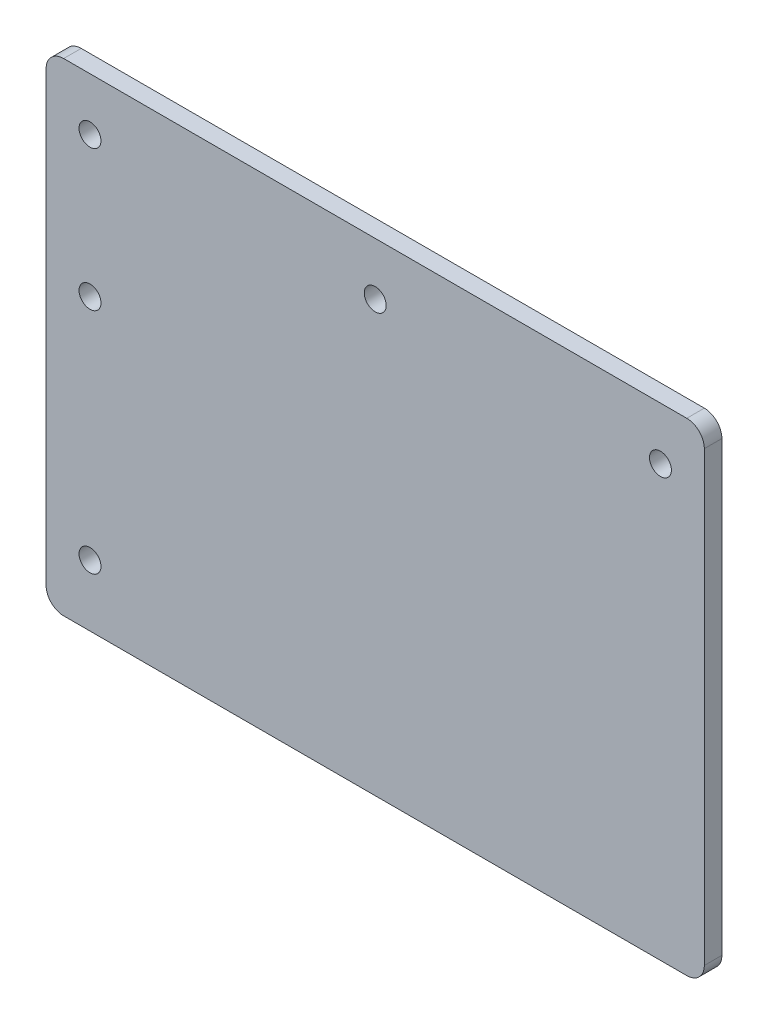
ISO-10303-21;
HEADER;
FILE_DESCRIPTION(('STEP AP214'),'2;1');
FILE_NAME('part.step','',(''),(''),'','','');
FILE_SCHEMA(('AUTOMOTIVE_DESIGN { 1 0 10303 214 1 1 1 1 }'));
ENDSEC;
DATA;
#1=APPLICATION_CONTEXT('core data for automotive mechanical design processes');
#2=APPLICATION_PROTOCOL_DEFINITION('international standard','automotive_design',2000,#1);
#3=PRODUCT_CONTEXT('',#1,'mechanical');
#4=PRODUCT('Part','Part','',(#3));
#5=PRODUCT_RELATED_PRODUCT_CATEGORY('part','',(#4));
#6=PRODUCT_DEFINITION_FORMATION('','',#4);
#7=PRODUCT_DEFINITION_CONTEXT('part definition',#1,'design');
#8=PRODUCT_DEFINITION('design','',#6,#7);
#9=PRODUCT_DEFINITION_SHAPE('','',#8);
#10=(LENGTH_UNIT() NAMED_UNIT(*) SI_UNIT(.MILLI.,.METRE.));
#11=(NAMED_UNIT(*) PLANE_ANGLE_UNIT() SI_UNIT($,.RADIAN.));
#12=(NAMED_UNIT(*) SI_UNIT($,.STERADIAN.) SOLID_ANGLE_UNIT());
#13=UNCERTAINTY_MEASURE_WITH_UNIT(LENGTH_MEASURE(1.E-05),#10,'distance_accuracy_value','');
#14=(GEOMETRIC_REPRESENTATION_CONTEXT(3) GLOBAL_UNCERTAINTY_ASSIGNED_CONTEXT((#13)) GLOBAL_UNIT_ASSIGNED_CONTEXT((#10,
#11,#12)) REPRESENTATION_CONTEXT('',''));
#15=CARTESIAN_POINT('',(0.,0.,0.));
#16=DIRECTION('',(0.,0.,1.));
#17=DIRECTION('',(1.,0.,0.));
#18=AXIS2_PLACEMENT_3D('',#15,#16,#17);
#19=CARTESIAN_POINT('',(-75.,55.,-4.));
#20=DIRECTION('',(0.,1.,0.));
#21=DIRECTION('',(0.,0.,1.));
#22=AXIS2_PLACEMENT_3D('',#19,#20,#21);
#23=PLANE('',#22);
#24=DIRECTION('',(-1.,0.,0.));
#25=VECTOR('',#24,1.);
#26=CARTESIAN_POINT('',(-75.,55.,0.));
#27=LINE('',#26,#25);
#28=CARTESIAN_POINT('',(70.9999999999998,55.0000000000004,0.));
#29=VERTEX_POINT('',#28);
#30=CARTESIAN_POINT('',(-71.,55.,0.));
#31=VERTEX_POINT('',#30);
#32=EDGE_CURVE('E162',#29,#31,#27,.T.);
#33=ORIENTED_EDGE('',*,*,#32,.F.);
#34=DIRECTION('',(0.,0.,1.));
#35=VECTOR('',#34,1.);
#36=CARTESIAN_POINT('',(70.9999999999998,55.0000000000004,-4.));
#37=LINE('',#36,#35);
#38=CARTESIAN_POINT('',(70.9999999999998,55.0000000000004,-4.));
#39=VERTEX_POINT('',#38);
#40=EDGE_CURVE('E142',#29,#39,#37,.F.);
#41=ORIENTED_EDGE('',*,*,#40,.T.);
#42=DIRECTION('',(-1.,0.,0.));
#43=VECTOR('',#42,1.);
#44=CARTESIAN_POINT('',(-75.,55.,-4.));
#45=LINE('',#44,#43);
#46=CARTESIAN_POINT('',(-71.,55.,-4.));
#47=VERTEX_POINT('',#46);
#48=EDGE_CURVE('E123',#39,#47,#45,.T.);
#49=ORIENTED_EDGE('',*,*,#48,.T.);
#50=DIRECTION('',(0.,0.,1.));
#51=VECTOR('',#50,1.);
#52=CARTESIAN_POINT('',(-71.,55.,-4.));
#53=LINE('',#52,#51);
#54=EDGE_CURVE('E139',#47,#31,#53,.T.);
#55=ORIENTED_EDGE('',*,*,#54,.T.);
#56=EDGE_LOOP('',(#33,#41,#49,#55));
#57=FACE_BOUND('',#56,.T.);
#58=ADVANCED_FACE('F36',(#57),#23,.T.);
#59=CARTESIAN_POINT('',(74.9999999999998,-54.9999999999996,-4.00000000000045));
#60=DIRECTION('',(1.,0.,0.));
#61=DIRECTION('',(0.,0.,-1.));
#62=AXIS2_PLACEMENT_3D('',#59,#60,#61);
#63=PLANE('',#62);
#64=DIRECTION('',(0.,1.,0.));
#65=VECTOR('',#64,1.);
#66=CARTESIAN_POINT('',(74.9999999999998,-54.9999999999996,-4.00000000000045));
#67=LINE('',#66,#65);
#68=CARTESIAN_POINT('',(74.9999999999998,-50.9999999999996,-4.));
#69=VERTEX_POINT('',#68);
#70=CARTESIAN_POINT('',(74.9999999999998,51.0000000000004,-4.));
#71=VERTEX_POINT('',#70);
#72=EDGE_CURVE('E128',#69,#71,#67,.T.);
#73=ORIENTED_EDGE('',*,*,#72,.T.);
#74=DIRECTION('',(0.,0.,1.));
#75=VECTOR('',#74,1.);
#76=CARTESIAN_POINT('',(74.9999999999998,51.0000000000004,-4.));
#77=LINE('',#76,#75);
#78=CARTESIAN_POINT('',(74.9999999999998,51.0000000000004,0.));
#79=VERTEX_POINT('',#78);
#80=EDGE_CURVE('E122',#71,#79,#77,.T.);
#81=ORIENTED_EDGE('',*,*,#80,.T.);
#82=DIRECTION('',(0.,1.,0.));
#83=VECTOR('',#82,1.);
#84=CARTESIAN_POINT('',(75.0000000000001,-54.9999999999996,-4.44089209850063E-13));
#85=LINE('',#84,#83);
#86=CARTESIAN_POINT('',(74.9999999999998,-50.9999999999996,0.));
#87=VERTEX_POINT('',#86);
#88=EDGE_CURVE('E105',#87,#79,#85,.T.);
#89=ORIENTED_EDGE('',*,*,#88,.F.);
#90=DIRECTION('',(0.,0.,1.));
#91=VECTOR('',#90,1.);
#92=CARTESIAN_POINT('',(74.9999999999998,-50.9999999999996,-4.));
#93=LINE('',#92,#91);
#94=EDGE_CURVE('E119',#87,#69,#93,.F.);
#95=ORIENTED_EDGE('',*,*,#94,.T.);
#96=EDGE_LOOP('',(#73,#81,#89,#95));
#97=FACE_BOUND('',#96,.T.);
#98=ADVANCED_FACE('F118',(#97),#63,.T.);
#99=CARTESIAN_POINT('',(74.9999999999998,-54.9999999999996,-4.00000000000045));
#100=DIRECTION('',(0.,-1.,0.));
#101=DIRECTION('',(1.,0.,0.));
#102=AXIS2_PLACEMENT_3D('',#99,#100,#101);
#103=PLANE('',#102);
#104=DIRECTION('',(1.,0.,0.));
#105=VECTOR('',#104,1.);
#106=CARTESIAN_POINT('',(74.9999999999998,-54.9999999999996,-4.00000000000045));
#107=LINE('',#106,#105);
#108=CARTESIAN_POINT('',(-71.,-55.,-4.00000000000045));
#109=VERTEX_POINT('',#108);
#110=CARTESIAN_POINT('',(70.9999999999998,-54.9999999999996,-4.00000000000045));
#111=VERTEX_POINT('',#110);
#112=EDGE_CURVE('E132',#109,#111,#107,.T.);
#113=ORIENTED_EDGE('',*,*,#112,.T.);
#114=DIRECTION('',(0.,0.,1.));
#115=VECTOR('',#114,1.);
#116=CARTESIAN_POINT('',(70.9999999999998,-54.9999999999996,-4.00000000000045));
#117=LINE('',#116,#115);
#118=CARTESIAN_POINT('',(71.0000000000001,-54.9999999999996,-4.44089209850063E-13));
#119=VERTEX_POINT('',#118);
#120=EDGE_CURVE('E152',#111,#119,#117,.T.);
#121=ORIENTED_EDGE('',*,*,#120,.T.);
#122=DIRECTION('',(1.,0.,0.));
#123=VECTOR('',#122,1.);
#124=CARTESIAN_POINT('',(75.0000000000001,-54.9999999999996,-4.44089209850063E-13));
#125=LINE('',#124,#123);
#126=CARTESIAN_POINT('',(-71.,-55.,-4.44089209850063E-13));
#127=VERTEX_POINT('',#126);
#128=EDGE_CURVE('E107',#127,#119,#125,.T.);
#129=ORIENTED_EDGE('',*,*,#128,.F.);
#130=DIRECTION('',(0.,0.,1.));
#131=VECTOR('',#130,1.);
#132=CARTESIAN_POINT('',(-71.,-55.,-4.00000000000045));
#133=LINE('',#132,#131);
#134=EDGE_CURVE('E150',#127,#109,#133,.F.);
#135=ORIENTED_EDGE('',*,*,#134,.T.);
#136=EDGE_LOOP('',(#113,#121,#129,#135));
#137=FACE_BOUND('',#136,.T.);
#138=ADVANCED_FACE('F155',(#137),#103,.T.);
#139=CARTESIAN_POINT('',(-75.,-55.,-4.00000000000045));
#140=DIRECTION('',(-1.,0.,0.));
#141=DIRECTION('',(0.,0.,1.));
#142=AXIS2_PLACEMENT_3D('',#139,#140,#141);
#143=PLANE('',#142);
#144=DIRECTION('',(0.,-1.,0.));
#145=VECTOR('',#144,1.);
#146=CARTESIAN_POINT('',(-75.,-55.,-4.00000000000045));
#147=LINE('',#146,#145);
#148=CARTESIAN_POINT('',(-75.,51.,-4.));
#149=VERTEX_POINT('',#148);
#150=CARTESIAN_POINT('',(-75.,-51.,-4.));
#151=VERTEX_POINT('',#150);
#152=EDGE_CURVE('E157',#149,#151,#147,.T.);
#153=ORIENTED_EDGE('',*,*,#152,.T.);
#154=DIRECTION('',(0.,0.,1.));
#155=VECTOR('',#154,1.);
#156=CARTESIAN_POINT('',(-75.,-51.,-4.));
#157=LINE('',#156,#155);
#158=CARTESIAN_POINT('',(-75.,-51.,0.));
#159=VERTEX_POINT('',#158);
#160=EDGE_CURVE('E11',#151,#159,#157,.T.);
#161=ORIENTED_EDGE('',*,*,#160,.T.);
#162=DIRECTION('',(0.,-1.,0.));
#163=VECTOR('',#162,1.);
#164=CARTESIAN_POINT('',(-75.,-55.,-4.44089209850063E-13));
#165=LINE('',#164,#163);
#166=CARTESIAN_POINT('',(-75.,51.,0.));
#167=VERTEX_POINT('',#166);
#168=EDGE_CURVE('E165',#167,#159,#165,.T.);
#169=ORIENTED_EDGE('',*,*,#168,.F.);
#170=DIRECTION('',(0.,0.,1.));
#171=VECTOR('',#170,1.);
#172=CARTESIAN_POINT('',(-75.,51.,-4.));
#173=LINE('',#172,#171);
#174=EDGE_CURVE('E44',#167,#149,#173,.F.);
#175=ORIENTED_EDGE('',*,*,#174,.T.);
#176=EDGE_LOOP('',(#153,#161,#169,#175));
#177=FACE_BOUND('',#176,.T.);
#178=ADVANCED_FACE('F168',(#177),#143,.T.);
#179=CARTESIAN_POINT('',(0.,0.,-4.));
#180=DIRECTION('',(0.,0.,1.));
#181=DIRECTION('',(1.,0.,0.));
#182=AXIS2_PLACEMENT_3D('',#179,#180,#181);
#183=PLANE('',#182);
#184=CARTESIAN_POINT('',(-65.,-41.,-4.));
#185=DIRECTION('',(0.,0.,1.));
#186=DIRECTION('',(1.,0.,0.));
#187=AXIS2_PLACEMENT_3D('',#184,#185,#186);
#188=CIRCLE('',#187,2.5);
#189=CARTESIAN_POINT('',(-62.5,-41.,-4.));
#190=VERTEX_POINT('',#189);
#191=EDGE_CURVE('E204',#190,#190,#188,.T.);
#192=ORIENTED_EDGE('',*,*,#191,.T.);
#193=EDGE_LOOP('',(#192));
#194=FACE_BOUND('',#193,.T.);
#195=CARTESIAN_POINT('',(-65.,11.,-4.));
#196=DIRECTION('',(0.,0.,1.));
#197=DIRECTION('',(1.,0.,0.));
#198=AXIS2_PLACEMENT_3D('',#195,#196,#197);
#199=CIRCLE('',#198,2.5);
#200=CARTESIAN_POINT('',(-62.5,11.,-4.));
#201=VERTEX_POINT('',#200);
#202=EDGE_CURVE('E198',#201,#201,#199,.T.);
#203=ORIENTED_EDGE('',*,*,#202,.T.);
#204=EDGE_LOOP('',(#203));
#205=FACE_BOUND('',#204,.T.);
#206=CARTESIAN_POINT('',(-65.,42.9999999999999,-4.));
#207=DIRECTION('',(0.,0.,1.));
#208=DIRECTION('',(1.,0.,0.));
#209=AXIS2_PLACEMENT_3D('',#206,#207,#208);
#210=CIRCLE('',#209,2.5);
#211=CARTESIAN_POINT('',(-62.5,42.9999999999999,-4.));
#212=VERTEX_POINT('',#211);
#213=EDGE_CURVE('E192',#212,#212,#210,.T.);
#214=ORIENTED_EDGE('',*,*,#213,.T.);
#215=EDGE_LOOP('',(#214));
#216=FACE_BOUND('',#215,.T.);
#217=CARTESIAN_POINT('',(65.,43.0000000000004,-4.));
#218=DIRECTION('',(0.,0.,1.));
#219=DIRECTION('',(1.,0.,0.));
#220=AXIS2_PLACEMENT_3D('',#217,#218,#219);
#221=CIRCLE('',#220,2.5);
#222=CARTESIAN_POINT('',(67.5,43.0000000000004,-4.));
#223=VERTEX_POINT('',#222);
#224=EDGE_CURVE('E186',#223,#223,#221,.T.);
#225=ORIENTED_EDGE('',*,*,#224,.T.);
#226=EDGE_LOOP('',(#225));
#227=FACE_BOUND('',#226,.T.);
#228=CARTESIAN_POINT('',(0.,43.,-4.));
#229=DIRECTION('',(0.,0.,1.));
#230=DIRECTION('',(1.,0.,0.));
#231=AXIS2_PLACEMENT_3D('',#228,#229,#230);
#232=CIRCLE('',#231,2.49999999999999);
#233=CARTESIAN_POINT('',(2.49999999999999,43.,-4.));
#234=VERTEX_POINT('',#233);
#235=EDGE_CURVE('E166',#234,#234,#232,.T.);
#236=ORIENTED_EDGE('',*,*,#235,.T.);
#237=EDGE_LOOP('',(#236));
#238=FACE_BOUND('',#237,.T.);
#239=ORIENTED_EDGE('',*,*,#48,.F.);
#240=CARTESIAN_POINT('',(70.9999999999998,51.0000000000004,-4.));
#241=DIRECTION('',(0.,0.,1.));
#242=DIRECTION('',(1.,0.,0.));
#243=AXIS2_PLACEMENT_3D('',#240,#241,#242);
#244=CIRCLE('',#243,4.);
#245=EDGE_CURVE('E148',#39,#71,#244,.F.);
#246=ORIENTED_EDGE('',*,*,#245,.T.);
#247=ORIENTED_EDGE('',*,*,#72,.F.);
#248=CARTESIAN_POINT('',(70.9999999999998,-50.9999999999996,-4.));
#249=DIRECTION('',(0.,0.,1.));
#250=DIRECTION('',(1.,0.,0.));
#251=AXIS2_PLACEMENT_3D('',#248,#249,#250);
#252=CIRCLE('',#251,4.);
#253=EDGE_CURVE('E127',#69,#111,#252,.F.);
#254=ORIENTED_EDGE('',*,*,#253,.T.);
#255=ORIENTED_EDGE('',*,*,#112,.F.);
#256=CARTESIAN_POINT('',(-71.,-51.,-4.));
#257=DIRECTION('',(0.,0.,1.));
#258=DIRECTION('',(1.,0.,0.));
#259=AXIS2_PLACEMENT_3D('',#256,#257,#258);
#260=CIRCLE('',#259,4.);
#261=EDGE_CURVE('E51',#109,#151,#260,.F.);
#262=ORIENTED_EDGE('',*,*,#261,.T.);
#263=ORIENTED_EDGE('',*,*,#152,.F.);
#264=CARTESIAN_POINT('',(-71.,51.,-4.));
#265=DIRECTION('',(0.,0.,1.));
#266=DIRECTION('',(1.,0.,0.));
#267=AXIS2_PLACEMENT_3D('',#264,#265,#266);
#268=CIRCLE('',#267,4.);
#269=EDGE_CURVE('E144',#149,#47,#268,.F.);
#270=ORIENTED_EDGE('',*,*,#269,.T.);
#271=EDGE_LOOP('',(#239,#246,#247,#254,#255,#262,#263,#270));
#272=FACE_BOUND('',#271,.T.);
#273=ADVANCED_FACE('F175',(#194,#205,#216,#227,#238,#272),#183,.F.);
#274=CARTESIAN_POINT('',(0.,0.,0.));
#275=DIRECTION('',(0.,0.,1.));
#276=DIRECTION('',(1.,0.,0.));
#277=AXIS2_PLACEMENT_3D('',#274,#275,#276);
#278=PLANE('',#277);
#279=CARTESIAN_POINT('',(-65.,-41.,0.));
#280=DIRECTION('',(0.,0.,1.));
#281=DIRECTION('',(1.,0.,0.));
#282=AXIS2_PLACEMENT_3D('',#279,#280,#281);
#283=CIRCLE('',#282,2.5);
#284=CARTESIAN_POINT('',(-62.5,-41.,0.));
#285=VERTEX_POINT('',#284);
#286=EDGE_CURVE('E207',#285,#285,#283,.T.);
#287=ORIENTED_EDGE('',*,*,#286,.F.);
#288=EDGE_LOOP('',(#287));
#289=FACE_BOUND('',#288,.T.);
#290=CARTESIAN_POINT('',(-65.,11.,0.));
#291=DIRECTION('',(0.,0.,1.));
#292=DIRECTION('',(1.,0.,0.));
#293=AXIS2_PLACEMENT_3D('',#290,#291,#292);
#294=CIRCLE('',#293,2.5);
#295=CARTESIAN_POINT('',(-62.5,11.,0.));
#296=VERTEX_POINT('',#295);
#297=EDGE_CURVE('E201',#296,#296,#294,.T.);
#298=ORIENTED_EDGE('',*,*,#297,.F.);
#299=EDGE_LOOP('',(#298));
#300=FACE_BOUND('',#299,.T.);
#301=CARTESIAN_POINT('',(-65.,42.9999999999999,0.));
#302=DIRECTION('',(0.,0.,1.));
#303=DIRECTION('',(1.,0.,0.));
#304=AXIS2_PLACEMENT_3D('',#301,#302,#303);
#305=CIRCLE('',#304,2.5);
#306=CARTESIAN_POINT('',(-62.5,42.9999999999999,0.));
#307=VERTEX_POINT('',#306);
#308=EDGE_CURVE('E195',#307,#307,#305,.T.);
#309=ORIENTED_EDGE('',*,*,#308,.F.);
#310=EDGE_LOOP('',(#309));
#311=FACE_BOUND('',#310,.T.);
#312=CARTESIAN_POINT('',(65.,43.0000000000004,0.));
#313=DIRECTION('',(0.,0.,1.));
#314=DIRECTION('',(1.,0.,0.));
#315=AXIS2_PLACEMENT_3D('',#312,#313,#314);
#316=CIRCLE('',#315,2.5);
#317=CARTESIAN_POINT('',(67.5,43.0000000000004,0.));
#318=VERTEX_POINT('',#317);
#319=EDGE_CURVE('E189',#318,#318,#316,.T.);
#320=ORIENTED_EDGE('',*,*,#319,.F.);
#321=EDGE_LOOP('',(#320));
#322=FACE_BOUND('',#321,.T.);
#323=CARTESIAN_POINT('',(0.,43.,0.));
#324=DIRECTION('',(0.,0.,1.));
#325=DIRECTION('',(1.,0.,0.));
#326=AXIS2_PLACEMENT_3D('',#323,#324,#325);
#327=CIRCLE('',#326,2.5);
#328=CARTESIAN_POINT('',(2.5,43.,0.));
#329=VERTEX_POINT('',#328);
#330=EDGE_CURVE('E183',#329,#329,#327,.T.);
#331=ORIENTED_EDGE('',*,*,#330,.F.);
#332=EDGE_LOOP('',(#331));
#333=FACE_BOUND('',#332,.T.);
#334=ORIENTED_EDGE('',*,*,#88,.T.);
#335=CARTESIAN_POINT('',(70.9999999999998,51.0000000000004,0.));
#336=DIRECTION('',(0.,0.,1.));
#337=DIRECTION('',(1.,0.,0.));
#338=AXIS2_PLACEMENT_3D('',#335,#336,#337);
#339=CIRCLE('',#338,4.);
#340=EDGE_CURVE('E112',#79,#29,#339,.T.);
#341=ORIENTED_EDGE('',*,*,#340,.T.);
#342=ORIENTED_EDGE('',*,*,#32,.T.);
#343=CARTESIAN_POINT('',(-71.,51.,0.));
#344=DIRECTION('',(0.,0.,1.));
#345=DIRECTION('',(1.,0.,0.));
#346=AXIS2_PLACEMENT_3D('',#343,#344,#345);
#347=CIRCLE('',#346,4.);
#348=EDGE_CURVE('E130',#31,#167,#347,.T.);
#349=ORIENTED_EDGE('',*,*,#348,.T.);
#350=ORIENTED_EDGE('',*,*,#168,.T.);
#351=CARTESIAN_POINT('',(-71.,-51.,0.));
#352=DIRECTION('',(0.,0.,1.));
#353=DIRECTION('',(1.,0.,0.));
#354=AXIS2_PLACEMENT_3D('',#351,#352,#353);
#355=CIRCLE('',#354,4.);
#356=EDGE_CURVE('E113',#159,#127,#355,.T.);
#357=ORIENTED_EDGE('',*,*,#356,.T.);
#358=ORIENTED_EDGE('',*,*,#128,.T.);
#359=CARTESIAN_POINT('',(70.9999999999998,-50.9999999999996,0.));
#360=DIRECTION('',(0.,0.,1.));
#361=DIRECTION('',(1.,0.,0.));
#362=AXIS2_PLACEMENT_3D('',#359,#360,#361);
#363=CIRCLE('',#362,4.);
#364=EDGE_CURVE('E102',#119,#87,#363,.T.);
#365=ORIENTED_EDGE('',*,*,#364,.T.);
#366=EDGE_LOOP('',(#334,#341,#342,#349,#350,#357,#358,#365));
#367=FACE_BOUND('',#366,.T.);
#368=ADVANCED_FACE('F104',(#289,#300,#311,#322,#333,#367),#278,.T.);
#369=CARTESIAN_POINT('',(0.,43.,0.));
#370=DIRECTION('',(0.,0.,1.));
#371=DIRECTION('',(1.,0.,0.));
#372=AXIS2_PLACEMENT_3D('',#369,#370,#371);
#373=CYLINDRICAL_SURFACE('',#372,2.49999999999999);
#374=ORIENTED_EDGE('',*,*,#330,.T.);
#375=EDGE_LOOP('',(#374));
#376=FACE_BOUND('',#375,.T.);
#377=ORIENTED_EDGE('',*,*,#235,.F.);
#378=EDGE_LOOP('',(#377));
#379=FACE_BOUND('',#378,.T.);
#380=ADVANCED_FACE('F216',(#376,#379),#373,.F.);
#381=CARTESIAN_POINT('',(65.,43.0000000000004,0.));
#382=DIRECTION('',(0.,0.,1.));
#383=DIRECTION('',(1.,0.,0.));
#384=AXIS2_PLACEMENT_3D('',#381,#382,#383);
#385=CYLINDRICAL_SURFACE('',#384,2.5);
#386=ORIENTED_EDGE('',*,*,#319,.T.);
#387=EDGE_LOOP('',(#386));
#388=FACE_BOUND('',#387,.T.);
#389=ORIENTED_EDGE('',*,*,#224,.F.);
#390=EDGE_LOOP('',(#389));
#391=FACE_BOUND('',#390,.T.);
#392=ADVANCED_FACE('F228',(#388,#391),#385,.F.);
#393=CARTESIAN_POINT('',(-65.,42.9999999999999,0.));
#394=DIRECTION('',(0.,0.,1.));
#395=DIRECTION('',(1.,0.,0.));
#396=AXIS2_PLACEMENT_3D('',#393,#394,#395);
#397=CYLINDRICAL_SURFACE('',#396,2.5);
#398=ORIENTED_EDGE('',*,*,#308,.T.);
#399=EDGE_LOOP('',(#398));
#400=FACE_BOUND('',#399,.T.);
#401=ORIENTED_EDGE('',*,*,#213,.F.);
#402=EDGE_LOOP('',(#401));
#403=FACE_BOUND('',#402,.T.);
#404=ADVANCED_FACE('F297',(#400,#403),#397,.F.);
#405=CARTESIAN_POINT('',(-65.,11.,0.));
#406=DIRECTION('',(0.,0.,1.));
#407=DIRECTION('',(1.,0.,0.));
#408=AXIS2_PLACEMENT_3D('',#405,#406,#407);
#409=CYLINDRICAL_SURFACE('',#408,2.5);
#410=ORIENTED_EDGE('',*,*,#297,.T.);
#411=EDGE_LOOP('',(#410));
#412=FACE_BOUND('',#411,.T.);
#413=ORIENTED_EDGE('',*,*,#202,.F.);
#414=EDGE_LOOP('',(#413));
#415=FACE_BOUND('',#414,.T.);
#416=ADVANCED_FACE('F288',(#412,#415),#409,.F.);
#417=CARTESIAN_POINT('',(-65.,-41.,0.));
#418=DIRECTION('',(0.,0.,1.));
#419=DIRECTION('',(1.,0.,0.));
#420=AXIS2_PLACEMENT_3D('',#417,#418,#419);
#421=CYLINDRICAL_SURFACE('',#420,2.5);
#422=ORIENTED_EDGE('',*,*,#286,.T.);
#423=EDGE_LOOP('',(#422));
#424=FACE_BOUND('',#423,.T.);
#425=ORIENTED_EDGE('',*,*,#191,.F.);
#426=EDGE_LOOP('',(#425));
#427=FACE_BOUND('',#426,.T.);
#428=ADVANCED_FACE('F211',(#424,#427),#421,.F.);
#429=CARTESIAN_POINT('',(70.9999999999998,51.0000000000004,-4.));
#430=DIRECTION('',(0.,0.,1.));
#431=DIRECTION('',(1.,0.,0.));
#432=AXIS2_PLACEMENT_3D('',#429,#430,#431);
#433=CYLINDRICAL_SURFACE('',#432,4.);
#434=ORIENTED_EDGE('',*,*,#245,.F.);
#435=ORIENTED_EDGE('',*,*,#40,.F.);
#436=ORIENTED_EDGE('',*,*,#340,.F.);
#437=ORIENTED_EDGE('',*,*,#80,.F.);
#438=EDGE_LOOP('',(#434,#435,#436,#437));
#439=FACE_BOUND('',#438,.T.);
#440=ADVANCED_FACE('F248',(#439),#433,.T.);
#441=CARTESIAN_POINT('',(70.9999999999998,-50.9999999999996,-4.));
#442=DIRECTION('',(0.,0.,1.));
#443=DIRECTION('',(1.,0.,0.));
#444=AXIS2_PLACEMENT_3D('',#441,#442,#443);
#445=CYLINDRICAL_SURFACE('',#444,4.);
#446=ORIENTED_EDGE('',*,*,#253,.F.);
#447=ORIENTED_EDGE('',*,*,#94,.F.);
#448=ORIENTED_EDGE('',*,*,#364,.F.);
#449=ORIENTED_EDGE('',*,*,#120,.F.);
#450=EDGE_LOOP('',(#446,#447,#448,#449));
#451=FACE_BOUND('',#450,.T.);
#452=ADVANCED_FACE('F126',(#451),#445,.T.);
#453=CARTESIAN_POINT('',(-71.,-51.,-4.));
#454=DIRECTION('',(0.,0.,1.));
#455=DIRECTION('',(1.,0.,0.));
#456=AXIS2_PLACEMENT_3D('',#453,#454,#455);
#457=CYLINDRICAL_SURFACE('',#456,4.);
#458=ORIENTED_EDGE('',*,*,#261,.F.);
#459=ORIENTED_EDGE('',*,*,#134,.F.);
#460=ORIENTED_EDGE('',*,*,#356,.F.);
#461=ORIENTED_EDGE('',*,*,#160,.F.);
#462=EDGE_LOOP('',(#458,#459,#460,#461));
#463=FACE_BOUND('',#462,.T.);
#464=ADVANCED_FACE('F253',(#463),#457,.T.);
#465=CARTESIAN_POINT('',(-71.,51.,-4.));
#466=DIRECTION('',(0.,0.,1.));
#467=DIRECTION('',(1.,0.,0.));
#468=AXIS2_PLACEMENT_3D('',#465,#466,#467);
#469=CYLINDRICAL_SURFACE('',#468,4.);
#470=ORIENTED_EDGE('',*,*,#269,.F.);
#471=ORIENTED_EDGE('',*,*,#174,.F.);
#472=ORIENTED_EDGE('',*,*,#348,.F.);
#473=ORIENTED_EDGE('',*,*,#54,.F.);
#474=EDGE_LOOP('',(#470,#471,#472,#473));
#475=FACE_BOUND('',#474,.T.);
#476=ADVANCED_FACE('F38',(#475),#469,.T.);
#477=CLOSED_SHELL('',(#58,#98,#138,#178,#273,#368,#380,#392,#404,#416,#428,#440,#452,#464,#476));
#478=MANIFOLD_SOLID_BREP('B2',#477);
#479=ADVANCED_BREP_SHAPE_REPRESENTATION('',(#18,#478),#14);
#480=SHAPE_DEFINITION_REPRESENTATION(#9,#479);
ENDSEC;
END-ISO-10303-21;
